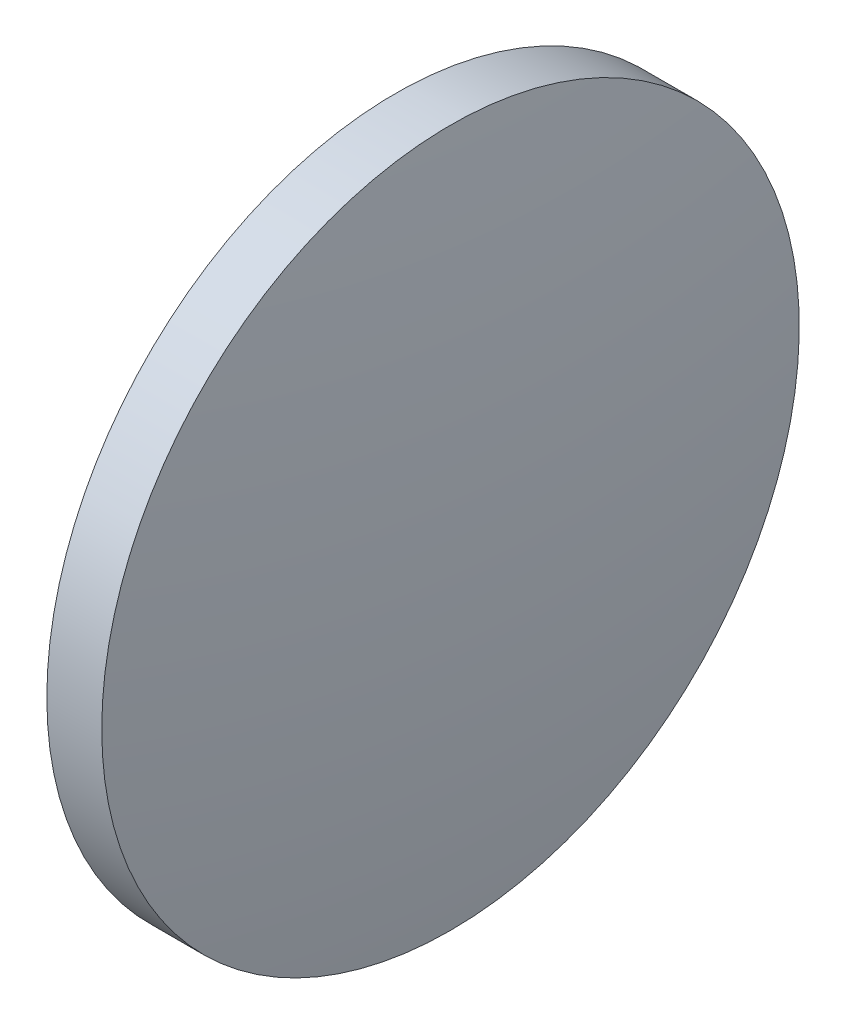
ISO-10303-21;
HEADER;
FILE_DESCRIPTION(('STEP AP214'),'2;1');
FILE_NAME('part.step','',(''),(''),'','','');
FILE_SCHEMA(('AUTOMOTIVE_DESIGN { 1 0 10303 214 1 1 1 1 }'));
ENDSEC;
DATA;
#1=APPLICATION_CONTEXT('core data for automotive mechanical design processes');
#2=APPLICATION_PROTOCOL_DEFINITION('international standard','automotive_design',2000,#1);
#3=PRODUCT_CONTEXT('',#1,'mechanical');
#4=PRODUCT('Part','Part','',(#3));
#5=PRODUCT_RELATED_PRODUCT_CATEGORY('part','',(#4));
#6=PRODUCT_DEFINITION_FORMATION('','',#4);
#7=PRODUCT_DEFINITION_CONTEXT('part definition',#1,'design');
#8=PRODUCT_DEFINITION('design','',#6,#7);
#9=PRODUCT_DEFINITION_SHAPE('','',#8);
#10=(LENGTH_UNIT() NAMED_UNIT(*) SI_UNIT(.MILLI.,.METRE.));
#11=(NAMED_UNIT(*) PLANE_ANGLE_UNIT() SI_UNIT($,.RADIAN.));
#12=(NAMED_UNIT(*) SI_UNIT($,.STERADIAN.) SOLID_ANGLE_UNIT());
#13=UNCERTAINTY_MEASURE_WITH_UNIT(LENGTH_MEASURE(1.E-05),#10,'distance_accuracy_value','');
#14=(GEOMETRIC_REPRESENTATION_CONTEXT(3) GLOBAL_UNCERTAINTY_ASSIGNED_CONTEXT((#13)) GLOBAL_UNIT_ASSIGNED_CONTEXT((#10,
#11,#12)) REPRESENTATION_CONTEXT('',''));
#15=CARTESIAN_POINT('',(0.,0.,0.));
#16=DIRECTION('',(0.,0.,1.));
#17=DIRECTION('',(1.,0.,0.));
#18=AXIS2_PLACEMENT_3D('',#15,#16,#17);
#19=CARTESIAN_POINT('',(990.202234164345,150.680985065657,0.));
#20=DIRECTION('',(-1.,0.,0.));
#21=DIRECTION('',(0.,-1.,0.));
#22=AXIS2_PLACEMENT_3D('',#19,#20,#21);
#23=SPHERICAL_SURFACE('',#22,90.055555555554);
#24=CARTESIAN_POINT('',(1079.3577897199,150.680985065656,0.));
#25=DIRECTION('',(-1.,0.,0.));
#26=DIRECTION('',(0.,0.,1.));
#27=AXIS2_PLACEMENT_3D('',#24,#25,#26);
#28=CIRCLE('',#27,12.7);
#29=CARTESIAN_POINT('',(1079.3577897199,150.680985065656,12.7));
#30=VERTEX_POINT('',#29);
#31=EDGE_CURVE('E10',#30,#30,#28,.T.);
#32=ORIENTED_EDGE('',*,*,#31,.F.);
#33=EDGE_LOOP('',(#32));
#34=FACE_BOUND('',#33,.T.);
#35=ADVANCED_FACE('F35',(#34),#23,.T.);
#36=CARTESIAN_POINT('',(1071.61957168422,150.680985065656,0.));
#37=DIRECTION('',(-1.,0.,0.));
#38=DIRECTION('',(0.,0.,1.));
#39=AXIS2_PLACEMENT_3D('',#36,#37,#38);
#40=CYLINDRICAL_SURFACE('',#39,12.7);
#41=CARTESIAN_POINT('',(1077.3577897199,150.680985065656,0.));
#42=DIRECTION('',(-1.,0.,0.));
#43=DIRECTION('',(0.,0.,1.));
#44=AXIS2_PLACEMENT_3D('',#41,#42,#43);
#45=CIRCLE('',#44,12.7);
#46=CARTESIAN_POINT('',(1077.3577897199,150.680985065656,12.7));
#47=VERTEX_POINT('',#46);
#48=EDGE_CURVE('E41',#47,#47,#45,.T.);
#49=ORIENTED_EDGE('',*,*,#48,.F.);
#50=EDGE_LOOP('',(#49));
#51=FACE_BOUND('',#50,.T.);
#52=ORIENTED_EDGE('',*,*,#31,.T.);
#53=EDGE_LOOP('',(#52));
#54=FACE_BOUND('',#53,.T.);
#55=ADVANCED_FACE('F49',(#51,#54),#40,.T.);
#56=CARTESIAN_POINT('',(1077.3577897199,150.680985065656,0.));
#57=DIRECTION('',(1.,0.,0.));
#58=DIRECTION('',(0.,0.,-1.));
#59=AXIS2_PLACEMENT_3D('',#56,#57,#58);
#60=PLANE('',#59);
#61=ORIENTED_EDGE('',*,*,#48,.T.);
#62=EDGE_LOOP('',(#61));
#63=FACE_BOUND('',#62,.T.);
#64=ADVANCED_FACE('F47',(#63),#60,.F.);
#65=CLOSED_SHELL('',(#35,#55,#64));
#66=MANIFOLD_SOLID_BREP('B2',#65);
#67=ADVANCED_BREP_SHAPE_REPRESENTATION('',(#18,#66),#14);
#68=SHAPE_DEFINITION_REPRESENTATION(#9,#67);
ENDSEC;
END-ISO-10303-21;
